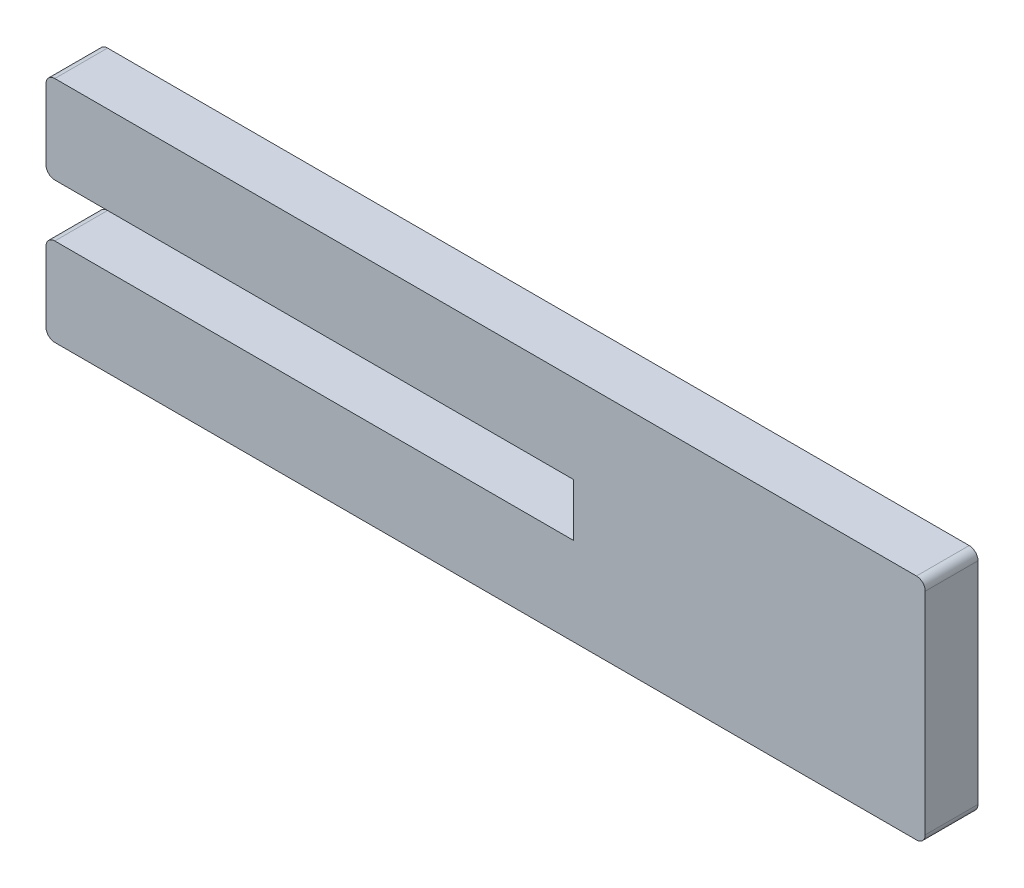
ISO-10303-21;
HEADER;
FILE_DESCRIPTION(('STEP AP214'),'2;1');
FILE_NAME('part.step','',(''),(''),'','','');
FILE_SCHEMA(('AUTOMOTIVE_DESIGN { 1 0 10303 214 1 1 1 1 }'));
ENDSEC;
DATA;
#1=APPLICATION_CONTEXT('core data for automotive mechanical design processes');
#2=APPLICATION_PROTOCOL_DEFINITION('international standard','automotive_design',2000,#1);
#3=PRODUCT_CONTEXT('',#1,'mechanical');
#4=PRODUCT('Part','Part','',(#3));
#5=PRODUCT_RELATED_PRODUCT_CATEGORY('part','',(#4));
#6=PRODUCT_DEFINITION_FORMATION('','',#4);
#7=PRODUCT_DEFINITION_CONTEXT('part definition',#1,'design');
#8=PRODUCT_DEFINITION('design','',#6,#7);
#9=PRODUCT_DEFINITION_SHAPE('','',#8);
#10=(LENGTH_UNIT() NAMED_UNIT(*) SI_UNIT(.MILLI.,.METRE.));
#11=(NAMED_UNIT(*) PLANE_ANGLE_UNIT() SI_UNIT($,.RADIAN.));
#12=(NAMED_UNIT(*) SI_UNIT($,.STERADIAN.) SOLID_ANGLE_UNIT());
#13=UNCERTAINTY_MEASURE_WITH_UNIT(LENGTH_MEASURE(1.E-05),#10,'distance_accuracy_value','');
#14=(GEOMETRIC_REPRESENTATION_CONTEXT(3) GLOBAL_UNCERTAINTY_ASSIGNED_CONTEXT((#13)) GLOBAL_UNIT_ASSIGNED_CONTEXT((#10,
#11,#12)) REPRESENTATION_CONTEXT('',''));
#15=CARTESIAN_POINT('',(0.,0.,0.));
#16=DIRECTION('',(0.,0.,1.));
#17=DIRECTION('',(1.,0.,0.));
#18=AXIS2_PLACEMENT_3D('',#15,#16,#17);
#19=CARTESIAN_POINT('',(0.,1.5,3.));
#20=DIRECTION('',(1.,0.,0.));
#21=DIRECTION('',(0.,0.,-1.));
#22=AXIS2_PLACEMENT_3D('',#19,#20,#21);
#23=PLANE('',#22);
#24=DIRECTION('',(0.,-1.,0.));
#25=VECTOR('',#24,1.);
#26=CARTESIAN_POINT('',(0.,1.5,0.));
#27=LINE('',#26,#25);
#28=CARTESIAN_POINT('',(0.,1.5,0.));
#29=VERTEX_POINT('',#28);
#30=CARTESIAN_POINT('',(0.,-1.5,0.));
#31=VERTEX_POINT('',#30);
#32=EDGE_CURVE('E169',#29,#31,#27,.T.);
#33=ORIENTED_EDGE('',*,*,#32,.T.);
#34=DIRECTION('',(0.,0.,-1.));
#35=VECTOR('',#34,1.);
#36=CARTESIAN_POINT('',(0.,-1.5,3.));
#37=LINE('',#36,#35);
#38=CARTESIAN_POINT('',(0.,-1.5,3.));
#39=VERTEX_POINT('',#38);
#40=EDGE_CURVE('E11',#39,#31,#37,.T.);
#41=ORIENTED_EDGE('',*,*,#40,.F.);
#42=DIRECTION('',(0.,-1.,0.));
#43=VECTOR('',#42,1.);
#44=CARTESIAN_POINT('',(0.,1.5,3.));
#45=LINE('',#44,#43);
#46=CARTESIAN_POINT('',(0.,1.5,3.));
#47=VERTEX_POINT('',#46);
#48=EDGE_CURVE('E196',#47,#39,#45,.T.);
#49=ORIENTED_EDGE('',*,*,#48,.F.);
#50=DIRECTION('',(0.,0.,-1.));
#51=VECTOR('',#50,1.);
#52=CARTESIAN_POINT('',(0.,1.5,3.));
#53=LINE('',#52,#51);
#54=EDGE_CURVE('E165',#47,#29,#53,.T.);
#55=ORIENTED_EDGE('',*,*,#54,.T.);
#56=EDGE_LOOP('',(#33,#41,#49,#55));
#57=FACE_BOUND('',#56,.T.);
#58=ADVANCED_FACE('F37',(#57),#23,.F.);
#59=CARTESIAN_POINT('',(-29.5,-1.5,3.));
#60=DIRECTION('',(0.,-1.,0.));
#61=DIRECTION('',(1.,0.,0.));
#62=AXIS2_PLACEMENT_3D('',#59,#60,#61);
#63=PLANE('',#62);
#64=DIRECTION('',(-1.,0.,0.));
#65=VECTOR('',#64,1.);
#66=CARTESIAN_POINT('',(-29.5,-1.5,0.));
#67=LINE('',#66,#65);
#68=CARTESIAN_POINT('',(-29.5,-1.5,0.));
#69=VERTEX_POINT('',#68);
#70=EDGE_CURVE('E172',#31,#69,#67,.T.);
#71=ORIENTED_EDGE('',*,*,#70,.T.);
#72=DIRECTION('',(0.,0.,-1.));
#73=VECTOR('',#72,1.);
#74=CARTESIAN_POINT('',(-29.5,-1.5,3.));
#75=LINE('',#74,#73);
#76=CARTESIAN_POINT('',(-29.5,-1.5,3.));
#77=VERTEX_POINT('',#76);
#78=EDGE_CURVE('E45',#77,#69,#75,.T.);
#79=ORIENTED_EDGE('',*,*,#78,.F.);
#80=DIRECTION('',(-1.,0.,0.));
#81=VECTOR('',#80,1.);
#82=CARTESIAN_POINT('',(-29.5,-1.5,3.));
#83=LINE('',#82,#81);
#84=EDGE_CURVE('E114',#39,#77,#83,.T.);
#85=ORIENTED_EDGE('',*,*,#84,.F.);
#86=ORIENTED_EDGE('',*,*,#40,.T.);
#87=EDGE_LOOP('',(#71,#79,#85,#86));
#88=FACE_BOUND('',#87,.T.);
#89=ADVANCED_FACE('F284',(#88),#63,.F.);
#90=CARTESIAN_POINT('',(-29.5,-2.00000000000001,3.));
#91=DIRECTION('',(0.,0.,-1.));
#92=DIRECTION('',(-1.,0.,0.));
#93=AXIS2_PLACEMENT_3D('',#90,#91,#92);
#94=CYLINDRICAL_SURFACE('',#93,0.500000000000002);
#95=CARTESIAN_POINT('',(-29.5,-2.00000000000001,0.));
#96=DIRECTION('',(0.,0.,1.));
#97=DIRECTION('',(-1.,0.,0.));
#98=AXIS2_PLACEMENT_3D('',#95,#96,#97);
#99=CIRCLE('',#98,0.500000000000002);
#100=CARTESIAN_POINT('',(-30.,-2.00000000000001,0.));
#101=VERTEX_POINT('',#100);
#102=EDGE_CURVE('E174',#69,#101,#99,.T.);
#103=ORIENTED_EDGE('',*,*,#102,.T.);
#104=DIRECTION('',(0.,0.,-1.));
#105=VECTOR('',#104,1.);
#106=CARTESIAN_POINT('',(-30.,-2.00000000000001,3.));
#107=LINE('',#106,#105);
#108=CARTESIAN_POINT('',(-30.,-2.00000000000001,3.));
#109=VERTEX_POINT('',#108);
#110=EDGE_CURVE('E221',#109,#101,#107,.T.);
#111=ORIENTED_EDGE('',*,*,#110,.F.);
#112=CARTESIAN_POINT('',(-29.5,-2.00000000000001,3.));
#113=DIRECTION('',(0.,0.,1.));
#114=DIRECTION('',(-1.,0.,0.));
#115=AXIS2_PLACEMENT_3D('',#112,#113,#114);
#116=CIRCLE('',#115,0.500000000000002);
#117=EDGE_CURVE('E229',#77,#109,#116,.T.);
#118=ORIENTED_EDGE('',*,*,#117,.F.);
#119=ORIENTED_EDGE('',*,*,#78,.T.);
#120=EDGE_LOOP('',(#103,#111,#118,#119));
#121=FACE_BOUND('',#120,.T.);
#122=ADVANCED_FACE('F227',(#121),#94,.T.);
#123=CARTESIAN_POINT('',(-30.,-2.00000000000001,3.));
#124=DIRECTION('',(1.,0.,0.));
#125=DIRECTION('',(0.,1.,0.));
#126=AXIS2_PLACEMENT_3D('',#123,#124,#125);
#127=PLANE('',#126);
#128=DIRECTION('',(0.,-1.,0.));
#129=VECTOR('',#128,1.);
#130=CARTESIAN_POINT('',(-30.,-2.00000000000001,0.));
#131=LINE('',#130,#129);
#132=CARTESIAN_POINT('',(-30.,-6.,0.));
#133=VERTEX_POINT('',#132);
#134=EDGE_CURVE('E176',#101,#133,#131,.T.);
#135=ORIENTED_EDGE('',*,*,#134,.T.);
#136=DIRECTION('',(0.,0.,-1.));
#137=VECTOR('',#136,1.);
#138=CARTESIAN_POINT('',(-30.,-6.,3.));
#139=LINE('',#138,#137);
#140=CARTESIAN_POINT('',(-30.,-6.,3.));
#141=VERTEX_POINT('',#140);
#142=EDGE_CURVE('E218',#141,#133,#139,.T.);
#143=ORIENTED_EDGE('',*,*,#142,.F.);
#144=DIRECTION('',(0.,-1.,0.));
#145=VECTOR('',#144,1.);
#146=CARTESIAN_POINT('',(-30.,-2.00000000000001,3.));
#147=LINE('',#146,#145);
#148=EDGE_CURVE('E247',#109,#141,#147,.T.);
#149=ORIENTED_EDGE('',*,*,#148,.F.);
#150=ORIENTED_EDGE('',*,*,#110,.T.);
#151=EDGE_LOOP('',(#135,#143,#149,#150));
#152=FACE_BOUND('',#151,.T.);
#153=ADVANCED_FACE('F238',(#152),#127,.F.);
#154=CARTESIAN_POINT('',(-29.5,-6.,3.));
#155=DIRECTION('',(0.,0.,-1.));
#156=DIRECTION('',(-1.,0.,0.));
#157=AXIS2_PLACEMENT_3D('',#154,#155,#156);
#158=CYLINDRICAL_SURFACE('',#157,0.5);
#159=CARTESIAN_POINT('',(-29.5,-6.,0.));
#160=DIRECTION('',(0.,0.,1.));
#161=DIRECTION('',(-1.,0.,0.));
#162=AXIS2_PLACEMENT_3D('',#159,#160,#161);
#163=CIRCLE('',#162,0.5);
#164=CARTESIAN_POINT('',(-29.5,-6.5,0.));
#165=VERTEX_POINT('',#164);
#166=EDGE_CURVE('E178',#133,#165,#163,.T.);
#167=ORIENTED_EDGE('',*,*,#166,.T.);
#168=DIRECTION('',(0.,0.,-1.));
#169=VECTOR('',#168,1.);
#170=CARTESIAN_POINT('',(-29.5,-6.5,3.));
#171=LINE('',#170,#169);
#172=CARTESIAN_POINT('',(-29.5,-6.5,3.));
#173=VERTEX_POINT('',#172);
#174=EDGE_CURVE('E215',#173,#165,#171,.T.);
#175=ORIENTED_EDGE('',*,*,#174,.F.);
#176=CARTESIAN_POINT('',(-29.5,-6.,3.));
#177=DIRECTION('',(0.,0.,1.));
#178=DIRECTION('',(-1.,0.,0.));
#179=AXIS2_PLACEMENT_3D('',#176,#177,#178);
#180=CIRCLE('',#179,0.5);
#181=EDGE_CURVE('E244',#141,#173,#180,.T.);
#182=ORIENTED_EDGE('',*,*,#181,.F.);
#183=ORIENTED_EDGE('',*,*,#142,.T.);
#184=EDGE_LOOP('',(#167,#175,#182,#183));
#185=FACE_BOUND('',#184,.T.);
#186=ADVANCED_FACE('F242',(#185),#158,.T.);
#187=CARTESIAN_POINT('',(-29.5,-6.5,3.));
#188=DIRECTION('',(0.,1.,0.));
#189=DIRECTION('',(-1.,0.,0.));
#190=AXIS2_PLACEMENT_3D('',#187,#188,#189);
#191=PLANE('',#190);
#192=DIRECTION('',(1.,0.,0.));
#193=VECTOR('',#192,1.);
#194=CARTESIAN_POINT('',(-29.5,-6.5,0.));
#195=LINE('',#194,#193);
#196=CARTESIAN_POINT('',(19.5,-6.5,0.));
#197=VERTEX_POINT('',#196);
#198=EDGE_CURVE('E180',#165,#197,#195,.T.);
#199=ORIENTED_EDGE('',*,*,#198,.T.);
#200=DIRECTION('',(0.,0.,-1.));
#201=VECTOR('',#200,1.);
#202=CARTESIAN_POINT('',(19.5,-6.5,3.));
#203=LINE('',#202,#201);
#204=CARTESIAN_POINT('',(19.5,-6.5,3.));
#205=VERTEX_POINT('',#204);
#206=EDGE_CURVE('E212',#205,#197,#203,.T.);
#207=ORIENTED_EDGE('',*,*,#206,.F.);
#208=DIRECTION('',(1.,0.,0.));
#209=VECTOR('',#208,1.);
#210=CARTESIAN_POINT('',(-29.5,-6.5,3.));
#211=LINE('',#210,#209);
#212=EDGE_CURVE('E246',#173,#205,#211,.T.);
#213=ORIENTED_EDGE('',*,*,#212,.F.);
#214=ORIENTED_EDGE('',*,*,#174,.T.);
#215=EDGE_LOOP('',(#199,#207,#213,#214));
#216=FACE_BOUND('',#215,.T.);
#217=ADVANCED_FACE('F297',(#216),#191,.F.);
#218=CARTESIAN_POINT('',(19.5,-5.99999999999999,3.));
#219=DIRECTION('',(0.,0.,-1.));
#220=DIRECTION('',(-1.,0.,0.));
#221=AXIS2_PLACEMENT_3D('',#218,#219,#220);
#222=CYLINDRICAL_SURFACE('',#221,0.500000000000006);
#223=CARTESIAN_POINT('',(19.5,-5.99999999999999,0.));
#224=DIRECTION('',(0.,0.,1.));
#225=DIRECTION('',(-1.,0.,0.));
#226=AXIS2_PLACEMENT_3D('',#223,#224,#225);
#227=CIRCLE('',#226,0.500000000000006);
#228=CARTESIAN_POINT('',(20.,-5.99999999999999,0.));
#229=VERTEX_POINT('',#228);
#230=EDGE_CURVE('E182',#197,#229,#227,.T.);
#231=ORIENTED_EDGE('',*,*,#230,.T.);
#232=DIRECTION('',(0.,0.,-1.));
#233=VECTOR('',#232,1.);
#234=CARTESIAN_POINT('',(20.,-5.99999999999999,3.));
#235=LINE('',#234,#233);
#236=CARTESIAN_POINT('',(20.,-5.99999999999999,3.));
#237=VERTEX_POINT('',#236);
#238=EDGE_CURVE('E209',#237,#229,#235,.T.);
#239=ORIENTED_EDGE('',*,*,#238,.F.);
#240=CARTESIAN_POINT('',(19.5,-5.99999999999999,3.));
#241=DIRECTION('',(0.,0.,1.));
#242=DIRECTION('',(-1.,0.,0.));
#243=AXIS2_PLACEMENT_3D('',#240,#241,#242);
#244=CIRCLE('',#243,0.500000000000006);
#245=EDGE_CURVE('E249',#205,#237,#244,.T.);
#246=ORIENTED_EDGE('',*,*,#245,.F.);
#247=ORIENTED_EDGE('',*,*,#206,.T.);
#248=EDGE_LOOP('',(#231,#239,#246,#247));
#249=FACE_BOUND('',#248,.T.);
#250=ADVANCED_FACE('F300',(#249),#222,.T.);
#251=CARTESIAN_POINT('',(20.,6.,3.));
#252=DIRECTION('',(-1.,0.,0.));
#253=DIRECTION('',(0.,-1.,0.));
#254=AXIS2_PLACEMENT_3D('',#251,#252,#253);
#255=PLANE('',#254);
#256=DIRECTION('',(0.,1.,0.));
#257=VECTOR('',#256,1.);
#258=CARTESIAN_POINT('',(20.,6.,0.));
#259=LINE('',#258,#257);
#260=CARTESIAN_POINT('',(20.,6.,0.));
#261=VERTEX_POINT('',#260);
#262=EDGE_CURVE('E185',#229,#261,#259,.T.);
#263=ORIENTED_EDGE('',*,*,#262,.T.);
#264=DIRECTION('',(0.,0.,-1.));
#265=VECTOR('',#264,1.);
#266=CARTESIAN_POINT('',(20.,6.,3.));
#267=LINE('',#266,#265);
#268=CARTESIAN_POINT('',(20.,6.,3.));
#269=VERTEX_POINT('',#268);
#270=EDGE_CURVE('E206',#269,#261,#267,.T.);
#271=ORIENTED_EDGE('',*,*,#270,.F.);
#272=DIRECTION('',(0.,1.,0.));
#273=VECTOR('',#272,1.);
#274=CARTESIAN_POINT('',(20.,-5.99999999999999,3.));
#275=LINE('',#274,#273);
#276=EDGE_CURVE('E255',#237,#269,#275,.T.);
#277=ORIENTED_EDGE('',*,*,#276,.F.);
#278=ORIENTED_EDGE('',*,*,#238,.T.);
#279=EDGE_LOOP('',(#263,#271,#277,#278));
#280=FACE_BOUND('',#279,.T.);
#281=ADVANCED_FACE('F304',(#280),#255,.F.);
#282=CARTESIAN_POINT('',(19.5,6.,3.));
#283=DIRECTION('',(0.,0.,-1.));
#284=DIRECTION('',(-1.,0.,0.));
#285=AXIS2_PLACEMENT_3D('',#282,#283,#284);
#286=CYLINDRICAL_SURFACE('',#285,0.500000000000006);
#287=CARTESIAN_POINT('',(19.5,6.,0.));
#288=DIRECTION('',(0.,0.,1.));
#289=DIRECTION('',(-1.,0.,0.));
#290=AXIS2_PLACEMENT_3D('',#287,#288,#289);
#291=CIRCLE('',#290,0.500000000000006);
#292=CARTESIAN_POINT('',(19.5,6.50000000000001,0.));
#293=VERTEX_POINT('',#292);
#294=EDGE_CURVE('E187',#261,#293,#291,.T.);
#295=ORIENTED_EDGE('',*,*,#294,.T.);
#296=DIRECTION('',(0.,0.,-1.));
#297=VECTOR('',#296,1.);
#298=CARTESIAN_POINT('',(19.5,6.50000000000001,3.));
#299=LINE('',#298,#297);
#300=CARTESIAN_POINT('',(19.5,6.50000000000001,3.));
#301=VERTEX_POINT('',#300);
#302=EDGE_CURVE('E203',#301,#293,#299,.T.);
#303=ORIENTED_EDGE('',*,*,#302,.F.);
#304=CARTESIAN_POINT('',(19.5,6.,3.));
#305=DIRECTION('',(0.,0.,1.));
#306=DIRECTION('',(-1.,0.,0.));
#307=AXIS2_PLACEMENT_3D('',#304,#305,#306);
#308=CIRCLE('',#307,0.500000000000006);
#309=EDGE_CURVE('E257',#269,#301,#308,.T.);
#310=ORIENTED_EDGE('',*,*,#309,.F.);
#311=ORIENTED_EDGE('',*,*,#270,.T.);
#312=EDGE_LOOP('',(#295,#303,#310,#311));
#313=FACE_BOUND('',#312,.T.);
#314=ADVANCED_FACE('F308',(#313),#286,.T.);
#315=CARTESIAN_POINT('',(-29.5,6.5,3.));
#316=DIRECTION('',(0.,-1.,0.));
#317=DIRECTION('',(1.,0.,0.));
#318=AXIS2_PLACEMENT_3D('',#315,#316,#317);
#319=PLANE('',#318);
#320=DIRECTION('',(-1.,0.,0.));
#321=VECTOR('',#320,1.);
#322=CARTESIAN_POINT('',(-29.5,6.5,0.));
#323=LINE('',#322,#321);
#324=CARTESIAN_POINT('',(-29.5,6.5,0.));
#325=VERTEX_POINT('',#324);
#326=EDGE_CURVE('E189',#293,#325,#323,.T.);
#327=ORIENTED_EDGE('',*,*,#326,.T.);
#328=DIRECTION('',(0.,0.,-1.));
#329=VECTOR('',#328,1.);
#330=CARTESIAN_POINT('',(-29.5,6.5,3.));
#331=LINE('',#330,#329);
#332=CARTESIAN_POINT('',(-29.5,6.5,3.));
#333=VERTEX_POINT('',#332);
#334=EDGE_CURVE('E200',#333,#325,#331,.T.);
#335=ORIENTED_EDGE('',*,*,#334,.F.);
#336=DIRECTION('',(-1.,0.,0.));
#337=VECTOR('',#336,1.);
#338=CARTESIAN_POINT('',(-29.5,6.5,3.));
#339=LINE('',#338,#337);
#340=EDGE_CURVE('E259',#301,#333,#339,.T.);
#341=ORIENTED_EDGE('',*,*,#340,.F.);
#342=ORIENTED_EDGE('',*,*,#302,.T.);
#343=EDGE_LOOP('',(#327,#335,#341,#342));
#344=FACE_BOUND('',#343,.T.);
#345=ADVANCED_FACE('F265',(#344),#319,.F.);
#346=CARTESIAN_POINT('',(-29.5,6.,3.));
#347=DIRECTION('',(0.,0.,-1.));
#348=DIRECTION('',(-1.,0.,0.));
#349=AXIS2_PLACEMENT_3D('',#346,#347,#348);
#350=CYLINDRICAL_SURFACE('',#349,0.5);
#351=CARTESIAN_POINT('',(-29.5,6.,0.));
#352=DIRECTION('',(0.,0.,1.));
#353=DIRECTION('',(-1.,0.,0.));
#354=AXIS2_PLACEMENT_3D('',#351,#352,#353);
#355=CIRCLE('',#354,0.5);
#356=CARTESIAN_POINT('',(-30.,6.,0.));
#357=VERTEX_POINT('',#356);
#358=EDGE_CURVE('E191',#325,#357,#355,.T.);
#359=ORIENTED_EDGE('',*,*,#358,.T.);
#360=DIRECTION('',(0.,0.,-1.));
#361=VECTOR('',#360,1.);
#362=CARTESIAN_POINT('',(-30.,6.,3.));
#363=LINE('',#362,#361);
#364=CARTESIAN_POINT('',(-30.,6.,3.));
#365=VERTEX_POINT('',#364);
#366=EDGE_CURVE('E160',#365,#357,#363,.T.);
#367=ORIENTED_EDGE('',*,*,#366,.F.);
#368=CARTESIAN_POINT('',(-29.5,6.,3.));
#369=DIRECTION('',(0.,0.,1.));
#370=DIRECTION('',(-1.,0.,0.));
#371=AXIS2_PLACEMENT_3D('',#368,#369,#370);
#372=CIRCLE('',#371,0.5);
#373=EDGE_CURVE('E151',#333,#365,#372,.T.);
#374=ORIENTED_EDGE('',*,*,#373,.F.);
#375=ORIENTED_EDGE('',*,*,#334,.T.);
#376=EDGE_LOOP('',(#359,#367,#374,#375));
#377=FACE_BOUND('',#376,.T.);
#378=ADVANCED_FACE('F269',(#377),#350,.T.);
#379=CARTESIAN_POINT('',(-30.,2.,3.));
#380=DIRECTION('',(1.,0.,0.));
#381=DIRECTION('',(0.,1.,0.));
#382=AXIS2_PLACEMENT_3D('',#379,#380,#381);
#383=PLANE('',#382);
#384=DIRECTION('',(0.,-1.,0.));
#385=VECTOR('',#384,1.);
#386=CARTESIAN_POINT('',(-30.,2.,0.));
#387=LINE('',#386,#385);
#388=CARTESIAN_POINT('',(-30.,2.,0.));
#389=VERTEX_POINT('',#388);
#390=EDGE_CURVE('E159',#357,#389,#387,.T.);
#391=ORIENTED_EDGE('',*,*,#390,.T.);
#392=DIRECTION('',(0.,0.,-1.));
#393=VECTOR('',#392,1.);
#394=CARTESIAN_POINT('',(-30.,2.,3.));
#395=LINE('',#394,#393);
#396=CARTESIAN_POINT('',(-30.,2.,3.));
#397=VERTEX_POINT('',#396);
#398=EDGE_CURVE('E156',#397,#389,#395,.T.);
#399=ORIENTED_EDGE('',*,*,#398,.F.);
#400=DIRECTION('',(0.,-1.,0.));
#401=VECTOR('',#400,1.);
#402=CARTESIAN_POINT('',(-30.,2.,3.));
#403=LINE('',#402,#401);
#404=EDGE_CURVE('E145',#365,#397,#403,.T.);
#405=ORIENTED_EDGE('',*,*,#404,.F.);
#406=ORIENTED_EDGE('',*,*,#366,.T.);
#407=EDGE_LOOP('',(#391,#399,#405,#406));
#408=FACE_BOUND('',#407,.T.);
#409=ADVANCED_FACE('F157',(#408),#383,.F.);
#410=CARTESIAN_POINT('',(-29.5,2.,3.));
#411=DIRECTION('',(0.,0.,-1.));
#412=DIRECTION('',(-1.,0.,0.));
#413=AXIS2_PLACEMENT_3D('',#410,#411,#412);
#414=CYLINDRICAL_SURFACE('',#413,0.500000000000002);
#415=CARTESIAN_POINT('',(-29.5,2.,0.));
#416=DIRECTION('',(0.,0.,1.));
#417=DIRECTION('',(-1.,0.,0.));
#418=AXIS2_PLACEMENT_3D('',#415,#416,#417);
#419=CIRCLE('',#418,0.500000000000002);
#420=CARTESIAN_POINT('',(-29.5,1.5,0.));
#421=VERTEX_POINT('',#420);
#422=EDGE_CURVE('E100',#389,#421,#419,.T.);
#423=ORIENTED_EDGE('',*,*,#422,.T.);
#424=DIRECTION('',(0.,0.,-1.));
#425=VECTOR('',#424,1.);
#426=CARTESIAN_POINT('',(-29.5,1.5,3.));
#427=LINE('',#426,#425);
#428=CARTESIAN_POINT('',(-29.5,1.5,3.));
#429=VERTEX_POINT('',#428);
#430=EDGE_CURVE('E161',#429,#421,#427,.T.);
#431=ORIENTED_EDGE('',*,*,#430,.F.);
#432=CARTESIAN_POINT('',(-29.5,2.,3.));
#433=DIRECTION('',(0.,0.,1.));
#434=DIRECTION('',(-1.,0.,0.));
#435=AXIS2_PLACEMENT_3D('',#432,#433,#434);
#436=CIRCLE('',#435,0.500000000000002);
#437=EDGE_CURVE('E149',#397,#429,#436,.T.);
#438=ORIENTED_EDGE('',*,*,#437,.F.);
#439=ORIENTED_EDGE('',*,*,#398,.T.);
#440=EDGE_LOOP('',(#423,#431,#438,#439));
#441=FACE_BOUND('',#440,.T.);
#442=ADVANCED_FACE('F163',(#441),#414,.T.);
#443=CARTESIAN_POINT('',(-29.5,1.5,3.));
#444=DIRECTION('',(0.,1.,0.));
#445=DIRECTION('',(-1.,0.,0.));
#446=AXIS2_PLACEMENT_3D('',#443,#444,#445);
#447=PLANE('',#446);
#448=DIRECTION('',(1.,0.,0.));
#449=VECTOR('',#448,1.);
#450=CARTESIAN_POINT('',(-29.5,1.5,0.));
#451=LINE('',#450,#449);
#452=EDGE_CURVE('E106',#421,#29,#451,.T.);
#453=ORIENTED_EDGE('',*,*,#452,.T.);
#454=ORIENTED_EDGE('',*,*,#54,.F.);
#455=DIRECTION('',(1.,0.,0.));
#456=VECTOR('',#455,1.);
#457=CARTESIAN_POINT('',(-29.5,1.5,3.));
#458=LINE('',#457,#456);
#459=EDGE_CURVE('E53',#429,#47,#458,.T.);
#460=ORIENTED_EDGE('',*,*,#459,.F.);
#461=ORIENTED_EDGE('',*,*,#430,.T.);
#462=EDGE_LOOP('',(#453,#454,#460,#461));
#463=FACE_BOUND('',#462,.T.);
#464=ADVANCED_FACE('F273',(#463),#447,.F.);
#465=CARTESIAN_POINT('',(-29.5,-2.00000000000001,3.));
#466=DIRECTION('',(0.,0.,-1.));
#467=DIRECTION('',(-1.,0.,0.));
#468=AXIS2_PLACEMENT_3D('',#465,#466,#467);
#469=PLANE('',#468);
#470=ORIENTED_EDGE('',*,*,#48,.T.);
#471=ORIENTED_EDGE('',*,*,#84,.T.);
#472=ORIENTED_EDGE('',*,*,#117,.T.);
#473=ORIENTED_EDGE('',*,*,#148,.T.);
#474=ORIENTED_EDGE('',*,*,#181,.T.);
#475=ORIENTED_EDGE('',*,*,#212,.T.);
#476=ORIENTED_EDGE('',*,*,#245,.T.);
#477=ORIENTED_EDGE('',*,*,#276,.T.);
#478=ORIENTED_EDGE('',*,*,#309,.T.);
#479=ORIENTED_EDGE('',*,*,#340,.T.);
#480=ORIENTED_EDGE('',*,*,#373,.T.);
#481=ORIENTED_EDGE('',*,*,#404,.T.);
#482=ORIENTED_EDGE('',*,*,#437,.T.);
#483=ORIENTED_EDGE('',*,*,#459,.T.);
#484=EDGE_LOOP('',(#470,#471,#472,#473,#474,#475,#476,#477,#478,#479,#480,#481,#482,#483));
#485=FACE_BOUND('',#484,.T.);
#486=ADVANCED_FACE('F147',(#485),#469,.F.);
#487=CARTESIAN_POINT('',(-29.5,-2.00000000000001,0.));
#488=DIRECTION('',(0.,0.,-1.));
#489=DIRECTION('',(-1.,0.,0.));
#490=AXIS2_PLACEMENT_3D('',#487,#488,#489);
#491=PLANE('',#490);
#492=ORIENTED_EDGE('',*,*,#32,.F.);
#493=ORIENTED_EDGE('',*,*,#452,.F.);
#494=ORIENTED_EDGE('',*,*,#422,.F.);
#495=ORIENTED_EDGE('',*,*,#390,.F.);
#496=ORIENTED_EDGE('',*,*,#358,.F.);
#497=ORIENTED_EDGE('',*,*,#326,.F.);
#498=ORIENTED_EDGE('',*,*,#294,.F.);
#499=ORIENTED_EDGE('',*,*,#262,.F.);
#500=ORIENTED_EDGE('',*,*,#230,.F.);
#501=ORIENTED_EDGE('',*,*,#198,.F.);
#502=ORIENTED_EDGE('',*,*,#166,.F.);
#503=ORIENTED_EDGE('',*,*,#134,.F.);
#504=ORIENTED_EDGE('',*,*,#102,.F.);
#505=ORIENTED_EDGE('',*,*,#70,.F.);
#506=EDGE_LOOP('',(#492,#493,#494,#495,#496,#497,#498,#499,#500,#501,#502,#503,#504,#505));
#507=FACE_BOUND('',#506,.T.);
#508=ADVANCED_FACE('F233',(#507),#491,.T.);
#509=CLOSED_SHELL('',(#58,#89,#122,#153,#186,#217,#250,#281,#314,#345,#378,#409,#442,#464,#486,#508));
#510=MANIFOLD_SOLID_BREP('B2',#509);
#511=ADVANCED_BREP_SHAPE_REPRESENTATION('',(#18,#510),#14);
#512=SHAPE_DEFINITION_REPRESENTATION(#9,#511);
ENDSEC;
END-ISO-10303-21;
